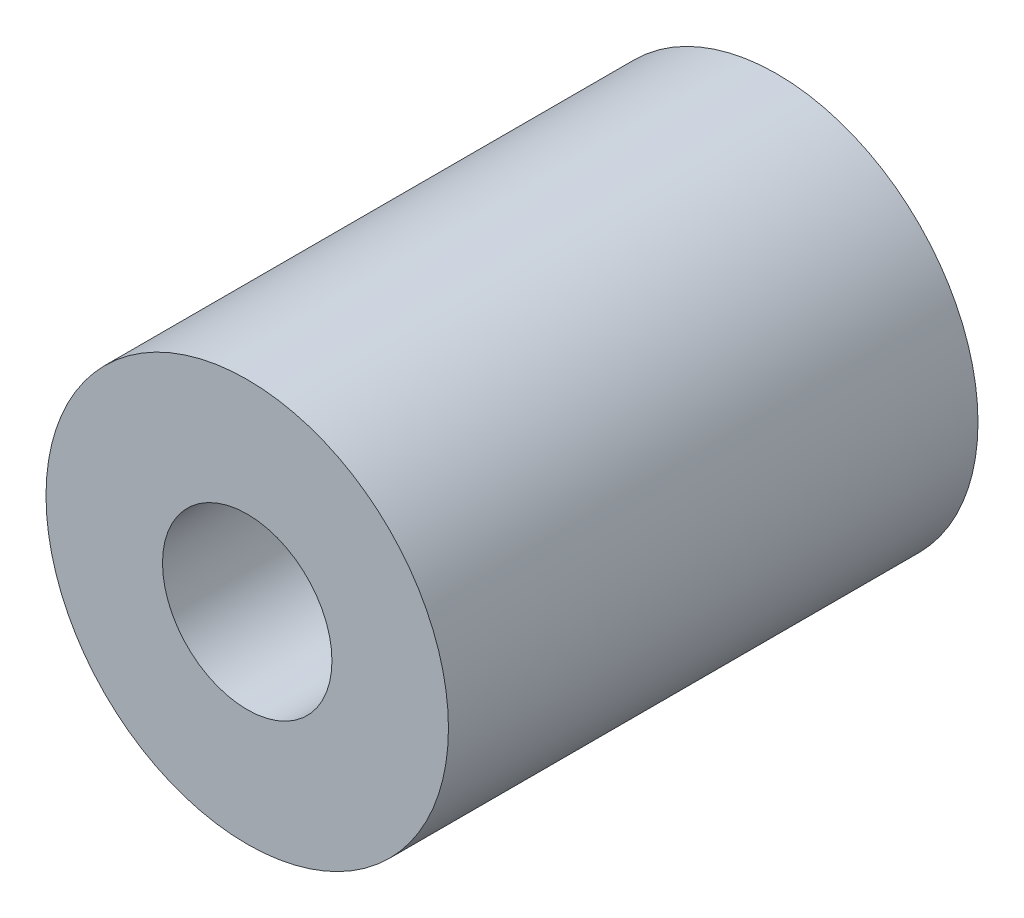
ISO-10303-21;
HEADER;
FILE_DESCRIPTION(('STEP AP214'),'2;1');
FILE_NAME('part.step','',(''),(''),'','','');
FILE_SCHEMA(('AUTOMOTIVE_DESIGN { 1 0 10303 214 1 1 1 1 }'));
ENDSEC;
DATA;
#1=APPLICATION_CONTEXT('core data for automotive mechanical design processes');
#2=APPLICATION_PROTOCOL_DEFINITION('international standard','automotive_design',2000,#1);
#3=PRODUCT_CONTEXT('',#1,'mechanical');
#4=PRODUCT('Part','Part','',(#3));
#5=PRODUCT_RELATED_PRODUCT_CATEGORY('part','',(#4));
#6=PRODUCT_DEFINITION_FORMATION('','',#4);
#7=PRODUCT_DEFINITION_CONTEXT('part definition',#1,'design');
#8=PRODUCT_DEFINITION('design','',#6,#7);
#9=PRODUCT_DEFINITION_SHAPE('','',#8);
#10=(LENGTH_UNIT() NAMED_UNIT(*) SI_UNIT(.MILLI.,.METRE.));
#11=(NAMED_UNIT(*) PLANE_ANGLE_UNIT() SI_UNIT($,.RADIAN.));
#12=(NAMED_UNIT(*) SI_UNIT($,.STERADIAN.) SOLID_ANGLE_UNIT());
#13=UNCERTAINTY_MEASURE_WITH_UNIT(LENGTH_MEASURE(1.E-05),#10,'distance_accuracy_value','');
#14=(GEOMETRIC_REPRESENTATION_CONTEXT(3) GLOBAL_UNCERTAINTY_ASSIGNED_CONTEXT((#13)) GLOBAL_UNIT_ASSIGNED_CONTEXT((#10,
#11,#12)) REPRESENTATION_CONTEXT('',''));
#15=CARTESIAN_POINT('',(0.,0.,0.));
#16=DIRECTION('',(0.,0.,1.));
#17=DIRECTION('',(1.,0.,0.));
#18=AXIS2_PLACEMENT_3D('',#15,#16,#17);
#19=CARTESIAN_POINT('',(0.,0.,25.));
#20=DIRECTION('',(0.,0.,-1.));
#21=DIRECTION('',(-1.,0.,0.));
#22=AXIS2_PLACEMENT_3D('',#19,#20,#21);
#23=CYLINDRICAL_SURFACE('',#22,9.5);
#24=CARTESIAN_POINT('',(0.,0.,25.));
#25=DIRECTION('',(0.,0.,1.));
#26=DIRECTION('',(1.,0.,0.));
#27=AXIS2_PLACEMENT_3D('',#24,#25,#26);
#28=CIRCLE('',#27,9.5);
#29=CARTESIAN_POINT('',(9.5,0.,25.));
#30=VERTEX_POINT('',#29);
#31=EDGE_CURVE('E10',#30,#30,#28,.T.);
#32=ORIENTED_EDGE('',*,*,#31,.F.);
#33=EDGE_LOOP('',(#32));
#34=FACE_BOUND('',#33,.T.);
#35=CARTESIAN_POINT('',(0.,0.,0.));
#36=DIRECTION('',(0.,0.,1.));
#37=DIRECTION('',(1.,0.,0.));
#38=AXIS2_PLACEMENT_3D('',#35,#36,#37);
#39=CIRCLE('',#38,9.5);
#40=CARTESIAN_POINT('',(9.5,0.,0.));
#41=VERTEX_POINT('',#40);
#42=EDGE_CURVE('E44',#41,#41,#39,.T.);
#43=ORIENTED_EDGE('',*,*,#42,.T.);
#44=EDGE_LOOP('',(#43));
#45=FACE_BOUND('',#44,.T.);
#46=ADVANCED_FACE('F41',(#34,#45),#23,.T.);
#47=CARTESIAN_POINT('',(0.,0.,25.));
#48=DIRECTION('',(0.,0.,1.));
#49=DIRECTION('',(1.,0.,0.));
#50=AXIS2_PLACEMENT_3D('',#47,#48,#49);
#51=PLANE('',#50);
#52=CARTESIAN_POINT('',(0.,0.,25.));
#53=DIRECTION('',(0.,0.,1.));
#54=DIRECTION('',(1.,0.,0.));
#55=AXIS2_PLACEMENT_3D('',#52,#53,#54);
#56=CIRCLE('',#55,4.);
#57=CARTESIAN_POINT('',(4.,0.,25.));
#58=VERTEX_POINT('',#57);
#59=EDGE_CURVE('E55',#58,#58,#56,.T.);
#60=ORIENTED_EDGE('',*,*,#59,.F.);
#61=EDGE_LOOP('',(#60));
#62=FACE_BOUND('',#61,.T.);
#63=ORIENTED_EDGE('',*,*,#31,.T.);
#64=EDGE_LOOP('',(#63));
#65=FACE_BOUND('',#64,.T.);
#66=ADVANCED_FACE('F84',(#62,#65),#51,.T.);
#67=CARTESIAN_POINT('',(0.,0.,0.));
#68=DIRECTION('',(0.,0.,1.));
#69=DIRECTION('',(1.,0.,0.));
#70=AXIS2_PLACEMENT_3D('',#67,#68,#69);
#71=PLANE('',#70);
#72=CARTESIAN_POINT('',(0.,0.,0.));
#73=DIRECTION('',(0.,0.,-1.));
#74=DIRECTION('',(-1.,0.,0.));
#75=AXIS2_PLACEMENT_3D('',#72,#73,#74);
#76=CIRCLE('',#75,3.);
#77=CARTESIAN_POINT('',(-3.,0.,0.));
#78=VERTEX_POINT('',#77);
#79=EDGE_CURVE('E63',#78,#78,#76,.T.);
#80=ORIENTED_EDGE('',*,*,#79,.F.);
#81=EDGE_LOOP('',(#80));
#82=FACE_BOUND('',#81,.T.);
#83=ORIENTED_EDGE('',*,*,#42,.F.);
#84=EDGE_LOOP('',(#83));
#85=FACE_BOUND('',#84,.T.);
#86=ADVANCED_FACE('F80',(#82,#85),#71,.F.);
#87=CARTESIAN_POINT('',(0.,0.,12.5));
#88=DIRECTION('',(0.,0.,1.));
#89=DIRECTION('',(1.,0.,0.));
#90=AXIS2_PLACEMENT_3D('',#87,#88,#89);
#91=CYLINDRICAL_SURFACE('',#90,4.);
#92=CARTESIAN_POINT('',(0.,0.,12.5));
#93=DIRECTION('',(0.,0.,1.));
#94=DIRECTION('',(1.,0.,0.));
#95=AXIS2_PLACEMENT_3D('',#92,#93,#94);
#96=CIRCLE('',#95,4.);
#97=CARTESIAN_POINT('',(4.,0.,12.5));
#98=VERTEX_POINT('',#97);
#99=EDGE_CURVE('E53',#98,#98,#96,.T.);
#100=ORIENTED_EDGE('',*,*,#99,.F.);
#101=EDGE_LOOP('',(#100));
#102=FACE_BOUND('',#101,.T.);
#103=ORIENTED_EDGE('',*,*,#59,.T.);
#104=EDGE_LOOP('',(#103));
#105=FACE_BOUND('',#104,.T.);
#106=ADVANCED_FACE('F83',(#102,#105),#91,.F.);
#107=CARTESIAN_POINT('',(0.,0.,12.5));
#108=DIRECTION('',(0.,0.,1.));
#109=DIRECTION('',(1.,0.,0.));
#110=AXIS2_PLACEMENT_3D('',#107,#108,#109);
#111=PLANE('',#110);
#112=CARTESIAN_POINT('',(0.,0.,12.5));
#113=DIRECTION('',(0.,0.,-1.));
#114=DIRECTION('',(-1.,0.,0.));
#115=AXIS2_PLACEMENT_3D('',#112,#113,#114);
#116=CIRCLE('',#115,3.);
#117=CARTESIAN_POINT('',(-3.,0.,12.5));
#118=VERTEX_POINT('',#117);
#119=EDGE_CURVE('E59',#118,#118,#116,.T.);
#120=ORIENTED_EDGE('',*,*,#119,.T.);
#121=EDGE_LOOP('',(#120));
#122=FACE_BOUND('',#121,.T.);
#123=ORIENTED_EDGE('',*,*,#99,.T.);
#124=EDGE_LOOP('',(#123));
#125=FACE_BOUND('',#124,.T.);
#126=ADVANCED_FACE('F71',(#122,#125),#111,.T.);
#127=CARTESIAN_POINT('',(0.,0.,12.5));
#128=DIRECTION('',(0.,0.,-1.));
#129=DIRECTION('',(-1.,0.,0.));
#130=AXIS2_PLACEMENT_3D('',#127,#128,#129);
#131=CYLINDRICAL_SURFACE('',#130,3.);
#132=ORIENTED_EDGE('',*,*,#119,.F.);
#133=EDGE_LOOP('',(#132));
#134=FACE_BOUND('',#133,.T.);
#135=ORIENTED_EDGE('',*,*,#79,.T.);
#136=EDGE_LOOP('',(#135));
#137=FACE_BOUND('',#136,.T.);
#138=ADVANCED_FACE('F74',(#134,#137),#131,.F.);
#139=CLOSED_SHELL('',(#46,#66,#86,#106,#126,#138));
#140=MANIFOLD_SOLID_BREP('B2',#139);
#141=ADVANCED_BREP_SHAPE_REPRESENTATION('',(#18,#140),#14);
#142=SHAPE_DEFINITION_REPRESENTATION(#9,#141);
ENDSEC;
END-ISO-10303-21;
